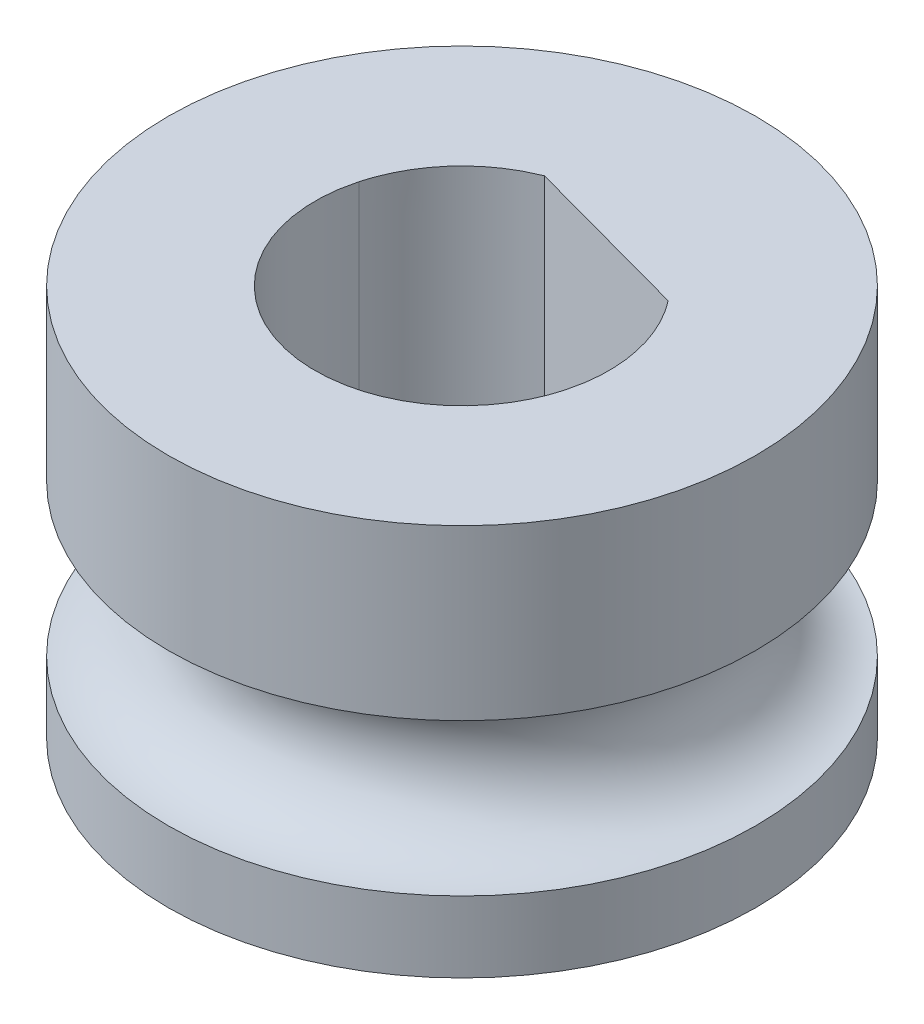
ISO-10303-21;
HEADER;
FILE_DESCRIPTION(('STEP AP214'),'2;1');
FILE_NAME('part.step','',(''),(''),'','','');
FILE_SCHEMA(('AUTOMOTIVE_DESIGN { 1 0 10303 214 1 1 1 1 }'));
ENDSEC;
DATA;
#1=APPLICATION_CONTEXT('core data for automotive mechanical design processes');
#2=APPLICATION_PROTOCOL_DEFINITION('international standard','automotive_design',2000,#1);
#3=PRODUCT_CONTEXT('',#1,'mechanical');
#4=PRODUCT('Part','Part','',(#3));
#5=PRODUCT_RELATED_PRODUCT_CATEGORY('part','',(#4));
#6=PRODUCT_DEFINITION_FORMATION('','',#4);
#7=PRODUCT_DEFINITION_CONTEXT('part definition',#1,'design');
#8=PRODUCT_DEFINITION('design','',#6,#7);
#9=PRODUCT_DEFINITION_SHAPE('','',#8);
#10=(LENGTH_UNIT() NAMED_UNIT(*) SI_UNIT(.MILLI.,.METRE.));
#11=(NAMED_UNIT(*) PLANE_ANGLE_UNIT() SI_UNIT($,.RADIAN.));
#12=(NAMED_UNIT(*) SI_UNIT($,.STERADIAN.) SOLID_ANGLE_UNIT());
#13=UNCERTAINTY_MEASURE_WITH_UNIT(LENGTH_MEASURE(1.E-05),#10,'distance_accuracy_value','');
#14=(GEOMETRIC_REPRESENTATION_CONTEXT(3) GLOBAL_UNCERTAINTY_ASSIGNED_CONTEXT((#13)) GLOBAL_UNIT_ASSIGNED_CONTEXT((#10,
#11,#12)) REPRESENTATION_CONTEXT('',''));
#15=CARTESIAN_POINT('',(0.,0.,0.));
#16=DIRECTION('',(0.,0.,1.));
#17=DIRECTION('',(1.,0.,0.));
#18=AXIS2_PLACEMENT_3D('',#15,#16,#17);
#19=CARTESIAN_POINT('',(0.,8.,0.));
#20=DIRECTION('',(0.,-1.,0.));
#21=DIRECTION('',(0.,0.,-1.));
#22=AXIS2_PLACEMENT_3D('',#19,#20,#21);
#23=CYLINDRICAL_SURFACE('',#22,6.);
#24=CARTESIAN_POINT('',(0.,1.45,0.));
#25=DIRECTION('',(0.,1.,0.));
#26=DIRECTION('',(-1.,0.,0.));
#27=AXIS2_PLACEMENT_3D('',#24,#25,#26);
#28=CIRCLE('',#27,6.);
#29=CARTESIAN_POINT('',(-6.,1.45,0.));
#30=VERTEX_POINT('',#29);
#31=EDGE_CURVE('E162',#30,#30,#28,.F.);
#32=ORIENTED_EDGE('',*,*,#31,.T.);
#33=EDGE_LOOP('',(#32));
#34=FACE_BOUND('',#33,.T.);
#35=CARTESIAN_POINT('',(0.,0.,0.));
#36=DIRECTION('',(0.,1.,0.));
#37=DIRECTION('',(0.,0.,1.));
#38=AXIS2_PLACEMENT_3D('',#35,#36,#37);
#39=CIRCLE('',#38,6.);
#40=CARTESIAN_POINT('',(0.,0.,6.));
#41=VERTEX_POINT('',#40);
#42=EDGE_CURVE('E43',#41,#41,#39,.T.);
#43=ORIENTED_EDGE('',*,*,#42,.T.);
#44=EDGE_LOOP('',(#43));
#45=FACE_BOUND('',#44,.T.);
#46=ADVANCED_FACE('F33',(#34,#45),#23,.T.);
#47=CARTESIAN_POINT('',(0.,0.,0.));
#48=DIRECTION('',(0.,1.,0.));
#49=DIRECTION('',(0.,0.,1.));
#50=AXIS2_PLACEMENT_3D('',#47,#48,#49);
#51=PLANE('',#50);
#52=DIRECTION('',(-0.964794008222106,0.,-0.263006695159501));
#53=VECTOR('',#52,1.);
#54=CARTESIAN_POINT('',(2.3678421066944,0.,-1.84209443421829));
#55=LINE('',#54,#53);
#56=CARTESIAN_POINT('',(2.3678421066944,0.,-1.84209443421829));
#57=VERTEX_POINT('',#56);
#58=CARTESIAN_POINT('',(-1.10541632421223,0.,-2.78891853714879));
#59=VERTEX_POINT('',#58);
#60=EDGE_CURVE('E88',#57,#59,#55,.T.);
#61=ORIENTED_EDGE('',*,*,#60,.T.);
#62=CARTESIAN_POINT('',(-2.89438194187999,0.,-0.789020062910618));
#63=CARTESIAN_POINT('',(-2.87818707018073,0.,-0.844775170705615));
#64=CARTESIAN_POINT('',(-2.84585131563616,0.,-0.956099515457794));
#65=CARTESIAN_POINT('',(-2.78522539030749,0.,-1.11908022549827));
#66=CARTESIAN_POINT('',(-2.71587740249985,0.,-1.27848112740415));
#67=CARTESIAN_POINT('',(-2.61098656335876,0.,-1.4852510902349));
#68=CARTESIAN_POINT('',(-2.45788712568269,0.,-1.73208364884266));
#69=CARTESIAN_POINT('',(-2.24091576794862,0.,-2.00451826668613));
#70=CARTESIAN_POINT('',(-1.99423549129414,0.,-2.25055012440572));
#71=CARTESIAN_POINT('',(-1.72025018563302,0.,-2.46534800029507));
#72=CARTESIAN_POINT('',(-1.42445447917242,0.,-2.65006149346232));
#73=CARTESIAN_POINT('',(-1.2117648879266,0.,-2.74263176257939));
#74=CARTESIAN_POINT('',(-1.10541632421223,0.,-2.78891853714879));
#75=B_SPLINE_CURVE_WITH_KNOTS('',3,(#62,#63,#64,#65,#66,#67,#68,#69,#70,#71,#72,#73,#74),
.UNSPECIFIED.,.F.,.F.,(4,1,1,1,1,1,1,1,1,1,4),(0.,0.0626218698765899,0.125034977186307,
0.187450302281109,0.250078803099406,0.375056772170109,0.500052515118078,0.62503048432018,
0.750026227535247,0.875008685135114,1.),.UNSPECIFIED.);
#76=CARTESIAN_POINT('',(-2.89438194187999,0.,-0.789020062910618));
#77=VERTEX_POINT('',#76);
#78=EDGE_CURVE('E81',#59,#77,#75,.F.);
#79=ORIENTED_EDGE('',*,*,#78,.T.);
#80=CARTESIAN_POINT('',(2.89438194187999,0.,0.789020062910618));
#81=CARTESIAN_POINT('',(2.87865189300581,0.,0.843345370205193));
#82=CARTESIAN_POINT('',(2.84731551994785,0.,0.951568689121028));
#83=CARTESIAN_POINT('',(2.78915543899612,0.,1.10982170933026));
#84=CARTESIAN_POINT('',(2.72309254530901,0.,1.26400209573233));
#85=CARTESIAN_POINT('',(2.64832599891892,0.,1.41388777543757));
#86=CARTESIAN_POINT('',(2.56507700955824,0.,1.55952933047464));
#87=CARTESIAN_POINT('',(2.47327087239857,0.,1.70091761899982));
#88=CARTESIAN_POINT('',(2.29100442960423,0.,1.95013867819124));
#89=CARTESIAN_POINT('',(1.98159751858744,0.,2.27961632889802));
#90=CARTESIAN_POINT('',(1.49807218422817,0.,2.62083625695806));
#91=CARTESIAN_POINT('',(0.958480559066191,0.,2.86434822474942));
#92=CARTESIAN_POINT('',(0.381062277549436,0.,2.99464237355238));
#93=CARTESIAN_POINT('',(-0.210611260113037,0.,3.01310253357515));
#94=CARTESIAN_POINT('',(-0.7939461692358,0.,2.91251619865619));
#95=CARTESIAN_POINT('',(-1.34764347926402,0.,2.70314638675546));
#96=CARTESIAN_POINT('',(-1.84808199197141,0.,2.38698260577468));
#97=CARTESIAN_POINT('',(-2.27951119843942,0.,1.98166654811925));
#98=CARTESIAN_POINT('',(-2.62085762548102,0.,1.49803244181816));
#99=CARTESIAN_POINT('',(-2.86436787719364,0.,0.958570492528802));
#100=CARTESIAN_POINT('',(-2.97297994943598,0.,0.476455314543193));
#101=CARTESIAN_POINT('',(-3.00405101215109,0.,0.0848176733777612));
#102=CARTESIAN_POINT('',(-2.99781925599359,0.,-0.209481258023923));
#103=CARTESIAN_POINT('',(-2.96416551950835,0.,-0.502228292962973));
#104=CARTESIAN_POINT('',(-2.9177189404248,0.,-0.69311126394398));
#105=CARTESIAN_POINT('',(-2.89438194187999,0.,-0.789020062910618));
#106=B_SPLINE_CURVE_WITH_KNOTS('',3,(#80,#81,#82,#83,#84,#85,#86,#87,#88,#89,#90,#91,#92,#93,
#94,#95,#96,#97,#98,#99,#100,#101,#102,#103,#104,#105),.UNSPECIFIED.,.F.,.F.,(4,1,1,1,1,1,1,1,1,
1,1,1,1,1,1,1,1,1,1,1,1,1,1,4),(0.,0.0180191577621083,0.0358965858491908,0.0536885215637202,
0.0714520142056296,0.0892443866757778,0.107122684086378,0.125143135562281,0.187619423544601,
0.250101049095049,0.312577336760583,0.375058962850168,0.437535250974874,0.500016876462905,
0.562493163451389,0.624974790021314,0.687451076596318,0.749932703789252,0.812408992779214,
0.874890617424314,0.906319786549686,0.937443979698974,0.968568842236843,1.),.UNSPECIFIED.);
#107=CARTESIAN_POINT('',(2.89438194187999,0.,0.789020062910618));
#108=VERTEX_POINT('',#107);
#109=EDGE_CURVE('E91',#77,#108,#106,.F.);
#110=ORIENTED_EDGE('',*,*,#109,.T.);
#111=CARTESIAN_POINT('',(2.3678421066944,0.,-1.84209443421829));
#112=CARTESIAN_POINT('',(2.40272930599221,0.,-1.79568541884751));
#113=CARTESIAN_POINT('',(2.47238740082254,0.,-1.70302210225153));
#114=CARTESIAN_POINT('',(2.56639650925765,0.,-1.55673277015611));
#115=CARTESIAN_POINT('',(2.65230852388607,0.,-1.40561366936521));
#116=CARTESIAN_POINT('',(2.75479009181369,0.,-1.19763878723376));
#117=CARTESIAN_POINT('',(2.86039657668171,0.,-0.927059399565007));
#118=CARTESIAN_POINT('',(2.94816153013277,0.,-0.590021165198057));
#119=CARTESIAN_POINT('',(2.99697888080313,0.,-0.245057447074246));
#120=CARTESIAN_POINT('',(3.00442598698757,0.,0.103009906491687));
#121=CARTESIAN_POINT('',(2.974719306481,0.,0.450474946522375));
#122=CARTESIAN_POINT('',(2.92116169589621,0.,0.67616902547246));
#123=CARTESIAN_POINT('',(2.89438194187999,0.,0.789020062910618));
#124=B_SPLINE_CURVE_WITH_KNOTS('',3,(#111,#112,#113,#114,#115,#116,#117,#118,#119,#120,#121,
#122,#123),.UNSPECIFIED.,.F.,.F.,(4,1,1,1,1,1,1,1,1,1,4),(0.,0.0626218705026635,
0.125034977920998,0.187450302599744,0.250078802475393,0.375056772167319,0.500052514655504,
0.625030485292895,0.750026227892294,0.875008685890589,1.),.UNSPECIFIED.);
#125=EDGE_CURVE('E51',#108,#57,#124,.F.);
#126=ORIENTED_EDGE('',*,*,#125,.T.);
#127=EDGE_LOOP('',(#61,#79,#110,#126));
#128=FACE_BOUND('',#127,.T.);
#129=ORIENTED_EDGE('',*,*,#42,.F.);
#130=EDGE_LOOP('',(#129));
#131=FACE_BOUND('',#130,.T.);
#132=ADVANCED_FACE('F98',(#128,#131),#51,.F.);
#133=CARTESIAN_POINT('',(0.,3.,0.));
#134=DIRECTION('',(0.,-1.,0.));
#135=DIRECTION('',(1.,0.,0.));
#136=AXIS2_PLACEMENT_3D('',#133,#134,#135);
#137=TOROIDAL_SURFACE('',#136,6.,1.55);
#138=CARTESIAN_POINT('',(0.,4.55,0.));
#139=DIRECTION('',(0.,-1.,0.));
#140=DIRECTION('',(1.,0.,0.));
#141=AXIS2_PLACEMENT_3D('',#138,#139,#140);
#142=CIRCLE('',#141,6.);
#143=CARTESIAN_POINT('',(6.,4.55,0.));
#144=VERTEX_POINT('',#143);
#145=EDGE_CURVE('E165',#144,#144,#142,.F.);
#146=ORIENTED_EDGE('',*,*,#145,.F.);
#147=EDGE_LOOP('',(#146));
#148=FACE_BOUND('',#147,.T.);
#149=ORIENTED_EDGE('',*,*,#31,.F.);
#150=EDGE_LOOP('',(#149));
#151=FACE_BOUND('',#150,.T.);
#152=ADVANCED_FACE('F115',(#148,#151),#137,.F.);
#153=CARTESIAN_POINT('',(0.,8.,0.));
#154=DIRECTION('',(0.,1.,0.));
#155=DIRECTION('',(0.,0.,1.));
#156=AXIS2_PLACEMENT_3D('',#153,#154,#155);
#157=PLANE('',#156);
#158=CARTESIAN_POINT('',(-1.10541632421223,8.,-2.78891853714879));
#159=CARTESIAN_POINT('',(-1.2117648879266,8.,-2.74263176257939));
#160=CARTESIAN_POINT('',(-1.42445447917242,8.,-2.65006149346232));
#161=CARTESIAN_POINT('',(-1.72025018563302,8.,-2.46534800029507));
#162=CARTESIAN_POINT('',(-1.99423549129414,8.,-2.25055012440572));
#163=CARTESIAN_POINT('',(-2.24091576794862,8.,-2.00451826668613));
#164=CARTESIAN_POINT('',(-2.45788712568269,8.,-1.73208364884266));
#165=CARTESIAN_POINT('',(-2.61098656335876,8.,-1.4852510902349));
#166=CARTESIAN_POINT('',(-2.71587740249985,8.,-1.27848112740415));
#167=CARTESIAN_POINT('',(-2.78522539030749,8.,-1.11908022549827));
#168=CARTESIAN_POINT('',(-2.84585131563616,8.,-0.956099515457794));
#169=CARTESIAN_POINT('',(-2.87818707018073,8.,-0.844775170705615));
#170=CARTESIAN_POINT('',(-2.89438194187999,8.,-0.789020062910618));
#171=B_SPLINE_CURVE_WITH_KNOTS('',3,(#158,#159,#160,#161,#162,#163,#164,#165,#166,#167,#168,
#169,#170),.UNSPECIFIED.,.F.,.F.,(4,1,1,1,1,1,1,1,1,1,4),(0.,0.124991314864886,
0.249973772464753,0.37496951567982,0.499947484881922,0.624943227829891,0.749921196900594,
0.812549697718891,0.874965022813693,0.93737813012341,1.),.UNSPECIFIED.);
#172=CARTESIAN_POINT('',(-1.10541632421223,8.,-2.78891853714879));
#173=VERTEX_POINT('',#172);
#174=CARTESIAN_POINT('',(-2.89438194187999,8.,-0.789020062910618));
#175=VERTEX_POINT('',#174);
#176=EDGE_CURVE('E60',#173,#175,#171,.T.);
#177=ORIENTED_EDGE('',*,*,#176,.F.);
#178=DIRECTION('',(-0.964794008222106,0.,-0.263006695159501));
#179=VECTOR('',#178,1.);
#180=CARTESIAN_POINT('',(2.3678421066944,8.,-1.84209443421829));
#181=LINE('',#180,#179);
#182=CARTESIAN_POINT('',(2.3678421066944,8.,-1.84209443421829));
#183=VERTEX_POINT('',#182);
#184=EDGE_CURVE('E101',#183,#173,#181,.T.);
#185=ORIENTED_EDGE('',*,*,#184,.F.);
#186=CARTESIAN_POINT('',(2.89438194187999,8.,0.789020062910618));
#187=CARTESIAN_POINT('',(2.92116169589621,8.,0.67616902547246));
#188=CARTESIAN_POINT('',(2.974719306481,8.,0.450474946522375));
#189=CARTESIAN_POINT('',(3.00442598698757,8.,0.103009906491687));
#190=CARTESIAN_POINT('',(2.99697888080313,8.,-0.245057447074246));
#191=CARTESIAN_POINT('',(2.94816153013277,8.,-0.590021165198057));
#192=CARTESIAN_POINT('',(2.86039657668171,8.,-0.927059399565007));
#193=CARTESIAN_POINT('',(2.75479009181369,8.,-1.19763878723376));
#194=CARTESIAN_POINT('',(2.65230852388607,8.,-1.40561366936521));
#195=CARTESIAN_POINT('',(2.56639650925765,8.,-1.55673277015611));
#196=CARTESIAN_POINT('',(2.47238740082254,8.,-1.70302210225153));
#197=CARTESIAN_POINT('',(2.40272930599221,8.,-1.79568541884751));
#198=CARTESIAN_POINT('',(2.3678421066944,8.,-1.84209443421829));
#199=B_SPLINE_CURVE_WITH_KNOTS('',3,(#186,#187,#188,#189,#190,#191,#192,#193,#194,#195,#196,
#197,#198),.UNSPECIFIED.,.F.,.F.,(4,1,1,1,1,1,1,1,1,1,4),(0.,0.124991314109411,
0.249973772107706,0.374969514707105,0.499947485344496,0.624943227832681,0.749921197524607,
0.812549697400256,0.874965022079002,0.937378129497336,1.),.UNSPECIFIED.);
#200=CARTESIAN_POINT('',(2.89438194187999,8.,0.789020062910618));
#201=VERTEX_POINT('',#200);
#202=EDGE_CURVE('E151',#201,#183,#199,.T.);
#203=ORIENTED_EDGE('',*,*,#202,.F.);
#204=CARTESIAN_POINT('',(-2.89438194187999,8.,-0.789020062910618));
#205=CARTESIAN_POINT('',(-2.9177189404248,8.,-0.69311126394398));
#206=CARTESIAN_POINT('',(-2.96416551950835,8.,-0.502228292962973));
#207=CARTESIAN_POINT('',(-2.99781925599359,8.,-0.209481258023923));
#208=CARTESIAN_POINT('',(-3.00405101215109,8.,0.0848176733777612));
#209=CARTESIAN_POINT('',(-2.97297994943598,8.,0.476455314543193));
#210=CARTESIAN_POINT('',(-2.86436787719364,8.,0.958570492528802));
#211=CARTESIAN_POINT('',(-2.62085762548102,8.,1.49803244181816));
#212=CARTESIAN_POINT('',(-2.27951119843942,8.,1.98166654811925));
#213=CARTESIAN_POINT('',(-1.84808199197141,8.,2.38698260577468));
#214=CARTESIAN_POINT('',(-1.34764347926402,8.,2.70314638675546));
#215=CARTESIAN_POINT('',(-0.7939461692358,8.,2.91251619865619));
#216=CARTESIAN_POINT('',(-0.210611260113037,8.,3.01310253357515));
#217=CARTESIAN_POINT('',(0.381062277549436,8.,2.99464237355238));
#218=CARTESIAN_POINT('',(0.958480559066191,8.,2.86434822474942));
#219=CARTESIAN_POINT('',(1.49807218422817,8.,2.62083625695806));
#220=CARTESIAN_POINT('',(1.98159751858744,8.,2.27961632889802));
#221=CARTESIAN_POINT('',(2.29100442960423,8.,1.95013867819124));
#222=CARTESIAN_POINT('',(2.47327087239857,8.,1.70091761899982));
#223=CARTESIAN_POINT('',(2.56507700955824,8.,1.55952933047464));
#224=CARTESIAN_POINT('',(2.64832599891892,8.,1.41388777543757));
#225=CARTESIAN_POINT('',(2.72309254530901,8.,1.26400209573233));
#226=CARTESIAN_POINT('',(2.78915543899612,8.,1.10982170933026));
#227=CARTESIAN_POINT('',(2.84731551994785,8.,0.951568689121028));
#228=CARTESIAN_POINT('',(2.87865189300581,8.,0.843345370205193));
#229=CARTESIAN_POINT('',(2.89438194187999,8.,0.789020062910618));
#230=B_SPLINE_CURVE_WITH_KNOTS('',3,(#204,#205,#206,#207,#208,#209,#210,#211,#212,#213,#214,
#215,#216,#217,#218,#219,#220,#221,#222,#223,#224,#225,#226,#227,#228,#229),.UNSPECIFIED.,.F.,
.F.,(4,1,1,1,1,1,1,1,1,1,1,1,1,1,1,1,1,1,1,1,1,1,1,4),(0.,0.0314311577631565,0.0625560203010261,
0.0936802134503143,0.125109382575686,0.187591007220786,0.250067296210748,0.312548923403682,
0.375025209978686,0.437506836548611,0.499983123537095,0.562464749025126,0.624941037149832,
0.687422663239417,0.749898950904951,0.812380576455399,0.874856864437719,0.892877315913622,
0.910755613324222,0.92854798579437,0.94631147843628,0.964103414150809,0.981980842237892,1.),.UNSPECIFIED.);
#231=EDGE_CURVE('E161',#175,#201,#230,.T.);
#232=ORIENTED_EDGE('',*,*,#231,.F.);
#233=EDGE_LOOP('',(#177,#185,#203,#232));
#234=FACE_BOUND('',#233,.T.);
#235=CARTESIAN_POINT('',(0.,8.,0.));
#236=DIRECTION('',(0.,1.,0.));
#237=DIRECTION('',(0.,0.,1.));
#238=AXIS2_PLACEMENT_3D('',#235,#236,#237);
#239=CIRCLE('',#238,6.);
#240=CARTESIAN_POINT('',(0.,8.,6.));
#241=VERTEX_POINT('',#240);
#242=EDGE_CURVE('E11',#241,#241,#239,.T.);
#243=ORIENTED_EDGE('',*,*,#242,.T.);
#244=EDGE_LOOP('',(#243));
#245=FACE_BOUND('',#244,.T.);
#246=ADVANCED_FACE('F116',(#234,#245),#157,.T.);
#247=ORIENTED_EDGE('',*,*,#145,.T.);
#248=EDGE_LOOP('',(#247));
#249=FACE_BOUND('',#248,.T.);
#250=ORIENTED_EDGE('',*,*,#242,.F.);
#251=EDGE_LOOP('',(#250));
#252=FACE_BOUND('',#251,.T.);
#253=ADVANCED_FACE('F35',(#249,#252),#23,.T.);
#254=CARTESIAN_POINT('',(-1.10541632421223,0.,-2.78891853714879));
#255=CARTESIAN_POINT('',(-1.2117648879266,0.,-2.74263176257939));
#256=CARTESIAN_POINT('',(-1.42445447917242,0.,-2.65006149346232));
#257=CARTESIAN_POINT('',(-1.72025018563302,0.,-2.46534800029507));
#258=CARTESIAN_POINT('',(-1.99423549129414,0.,-2.25055012440572));
#259=CARTESIAN_POINT('',(-2.24091576794862,0.,-2.00451826668613));
#260=CARTESIAN_POINT('',(-2.45788712568269,0.,-1.73208364884266));
#261=CARTESIAN_POINT('',(-2.61098656335876,0.,-1.4852510902349));
#262=CARTESIAN_POINT('',(-2.71587740249985,0.,-1.27848112740415));
#263=CARTESIAN_POINT('',(-2.78522539030749,0.,-1.11908022549827));
#264=CARTESIAN_POINT('',(-2.84585131563616,0.,-0.956099515457794));
#265=CARTESIAN_POINT('',(-2.87818707018073,0.,-0.844775170705615));
#266=CARTESIAN_POINT('',(-2.89438194187999,0.,-0.789020062910618));
#267=B_SPLINE_CURVE_WITH_KNOTS('',3,(#254,#255,#256,#257,#258,#259,#260,#261,#262,#263,#264,
#265,#266),.UNSPECIFIED.,.F.,.F.,(4,1,1,1,1,1,1,1,1,1,4),(0.,0.124991314864886,
0.249973772464753,0.37496951567982,0.499947484881922,0.624943227829891,0.749921196900594,
0.812549697718891,0.874965022813693,0.93737813012341,1.),.UNSPECIFIED.);
#268=DIRECTION('',(0.,1.,0.));
#269=VECTOR('',#268,1.);
#270=SURFACE_OF_LINEAR_EXTRUSION('',#267,#269);
#271=ORIENTED_EDGE('',*,*,#176,.T.);
#272=DIRECTION('',(0.,1.,0.));
#273=VECTOR('',#272,1.);
#274=CARTESIAN_POINT('',(-2.89438194187999,0.,-0.789020062910618));
#275=LINE('',#274,#273);
#276=EDGE_CURVE('E77',#77,#175,#275,.T.);
#277=ORIENTED_EDGE('',*,*,#276,.F.);
#278=ORIENTED_EDGE('',*,*,#78,.F.);
#279=DIRECTION('',(0.,1.,0.));
#280=VECTOR('',#279,1.);
#281=CARTESIAN_POINT('',(-1.10541632421223,0.,-2.78891853714879));
#282=LINE('',#281,#280);
#283=EDGE_CURVE('E168',#59,#173,#282,.T.);
#284=ORIENTED_EDGE('',*,*,#283,.T.);
#285=EDGE_LOOP('',(#271,#277,#278,#284));
#286=FACE_BOUND('',#285,.T.);
#287=ADVANCED_FACE('F79',(#286),#270,.F.);
#288=CARTESIAN_POINT('',(2.3678421066944,0.,-1.84209443421829));
#289=DIRECTION('',(0.2630066951595,0.,-0.964794008222106));
#290=DIRECTION('',(-0.964794008222106,0.,-0.263006695159501));
#291=AXIS2_PLACEMENT_3D('',#288,#289,#290);
#292=PLANE('',#291);
#293=ORIENTED_EDGE('',*,*,#184,.T.);
#294=ORIENTED_EDGE('',*,*,#283,.F.);
#295=ORIENTED_EDGE('',*,*,#60,.F.);
#296=DIRECTION('',(0.,1.,0.));
#297=VECTOR('',#296,1.);
#298=CARTESIAN_POINT('',(2.3678421066944,0.,-1.84209443421829));
#299=LINE('',#298,#297);
#300=EDGE_CURVE('E251',#57,#183,#299,.T.);
#301=ORIENTED_EDGE('',*,*,#300,.T.);
#302=EDGE_LOOP('',(#293,#294,#295,#301));
#303=FACE_BOUND('',#302,.T.);
#304=ADVANCED_FACE('F184',(#303),#292,.F.);
#305=CARTESIAN_POINT('',(2.89438194187999,0.,0.789020062910618));
#306=CARTESIAN_POINT('',(2.92116169589621,0.,0.67616902547246));
#307=CARTESIAN_POINT('',(2.974719306481,0.,0.450474946522375));
#308=CARTESIAN_POINT('',(3.00442598698757,0.,0.103009906491687));
#309=CARTESIAN_POINT('',(2.99697888080313,0.,-0.245057447074246));
#310=CARTESIAN_POINT('',(2.94816153013277,0.,-0.590021165198057));
#311=CARTESIAN_POINT('',(2.86039657668171,0.,-0.927059399565007));
#312=CARTESIAN_POINT('',(2.75479009181369,0.,-1.19763878723376));
#313=CARTESIAN_POINT('',(2.65230852388607,0.,-1.40561366936521));
#314=CARTESIAN_POINT('',(2.56639650925765,0.,-1.55673277015611));
#315=CARTESIAN_POINT('',(2.47238740082254,0.,-1.70302210225153));
#316=CARTESIAN_POINT('',(2.40272930599221,0.,-1.79568541884751));
#317=CARTESIAN_POINT('',(2.3678421066944,0.,-1.84209443421829));
#318=B_SPLINE_CURVE_WITH_KNOTS('',3,(#305,#306,#307,#308,#309,#310,#311,#312,#313,#314,#315,
#316,#317),.UNSPECIFIED.,.F.,.F.,(4,1,1,1,1,1,1,1,1,1,4),(0.,0.124991314109411,
0.249973772107706,0.374969514707105,0.499947485344496,0.624943227832681,0.749921197524607,
0.812549697400256,0.874965022079002,0.937378129497336,1.),.UNSPECIFIED.);
#319=DIRECTION('',(0.,1.,0.));
#320=VECTOR('',#319,1.);
#321=SURFACE_OF_LINEAR_EXTRUSION('',#318,#320);
#322=ORIENTED_EDGE('',*,*,#202,.T.);
#323=ORIENTED_EDGE('',*,*,#300,.F.);
#324=ORIENTED_EDGE('',*,*,#125,.F.);
#325=DIRECTION('',(0.,1.,0.));
#326=VECTOR('',#325,1.);
#327=CARTESIAN_POINT('',(2.89438194187999,0.,0.789020062910618));
#328=LINE('',#327,#326);
#329=EDGE_CURVE('E87',#108,#201,#328,.T.);
#330=ORIENTED_EDGE('',*,*,#329,.T.);
#331=EDGE_LOOP('',(#322,#323,#324,#330));
#332=FACE_BOUND('',#331,.T.);
#333=ADVANCED_FACE('F210',(#332),#321,.F.);
#334=CARTESIAN_POINT('',(-2.89438194187999,0.,-0.789020062910618));
#335=CARTESIAN_POINT('',(-2.9177189404248,0.,-0.69311126394398));
#336=CARTESIAN_POINT('',(-2.96416551950835,0.,-0.502228292962973));
#337=CARTESIAN_POINT('',(-2.99781925599359,0.,-0.209481258023923));
#338=CARTESIAN_POINT('',(-3.00405101215109,0.,0.0848176733777612));
#339=CARTESIAN_POINT('',(-2.97297994943598,0.,0.476455314543193));
#340=CARTESIAN_POINT('',(-2.86436787719364,0.,0.958570492528802));
#341=CARTESIAN_POINT('',(-2.62085762548102,0.,1.49803244181816));
#342=CARTESIAN_POINT('',(-2.27951119843942,0.,1.98166654811925));
#343=CARTESIAN_POINT('',(-1.84808199197141,0.,2.38698260577468));
#344=CARTESIAN_POINT('',(-1.34764347926402,0.,2.70314638675546));
#345=CARTESIAN_POINT('',(-0.7939461692358,0.,2.91251619865619));
#346=CARTESIAN_POINT('',(-0.210611260113037,0.,3.01310253357515));
#347=CARTESIAN_POINT('',(0.381062277549436,0.,2.99464237355238));
#348=CARTESIAN_POINT('',(0.958480559066191,0.,2.86434822474942));
#349=CARTESIAN_POINT('',(1.49807218422817,0.,2.62083625695806));
#350=CARTESIAN_POINT('',(1.98159751858744,0.,2.27961632889802));
#351=CARTESIAN_POINT('',(2.29100442960423,0.,1.95013867819124));
#352=CARTESIAN_POINT('',(2.47327087239857,0.,1.70091761899982));
#353=CARTESIAN_POINT('',(2.56507700955824,0.,1.55952933047464));
#354=CARTESIAN_POINT('',(2.64832599891892,0.,1.41388777543757));
#355=CARTESIAN_POINT('',(2.72309254530901,0.,1.26400209573233));
#356=CARTESIAN_POINT('',(2.78915543899612,0.,1.10982170933026));
#357=CARTESIAN_POINT('',(2.84731551994785,0.,0.951568689121028));
#358=CARTESIAN_POINT('',(2.87865189300581,0.,0.843345370205193));
#359=CARTESIAN_POINT('',(2.89438194187999,0.,0.789020062910618));
#360=B_SPLINE_CURVE_WITH_KNOTS('',3,(#334,#335,#336,#337,#338,#339,#340,#341,#342,#343,#344,
#345,#346,#347,#348,#349,#350,#351,#352,#353,#354,#355,#356,#357,#358,#359),.UNSPECIFIED.,.F.,
.F.,(4,1,1,1,1,1,1,1,1,1,1,1,1,1,1,1,1,1,1,1,1,1,1,4),(0.,0.0314311577631565,0.0625560203010261,
0.0936802134503143,0.125109382575686,0.187591007220786,0.250067296210748,0.312548923403682,
0.375025209978686,0.437506836548611,0.499983123537095,0.562464749025126,0.624941037149832,
0.687422663239417,0.749898950904951,0.812380576455399,0.874856864437719,0.892877315913622,
0.910755613324222,0.92854798579437,0.94631147843628,0.964103414150809,0.981980842237892,1.),.UNSPECIFIED.);
#361=DIRECTION('',(0.,1.,0.));
#362=VECTOR('',#361,1.);
#363=SURFACE_OF_LINEAR_EXTRUSION('',#360,#362);
#364=ORIENTED_EDGE('',*,*,#231,.T.);
#365=ORIENTED_EDGE('',*,*,#329,.F.);
#366=ORIENTED_EDGE('',*,*,#109,.F.);
#367=ORIENTED_EDGE('',*,*,#276,.T.);
#368=EDGE_LOOP('',(#364,#365,#366,#367));
#369=FACE_BOUND('',#368,.T.);
#370=ADVANCED_FACE('F93',(#369),#363,.F.);
#371=CLOSED_SHELL('',(#46,#132,#152,#246,#253,#287,#304,#333,#370));
#372=MANIFOLD_SOLID_BREP('B2',#371);
#373=ADVANCED_BREP_SHAPE_REPRESENTATION('',(#18,#372),#14);
#374=SHAPE_DEFINITION_REPRESENTATION(#9,#373);
ENDSEC;
END-ISO-10303-21;
